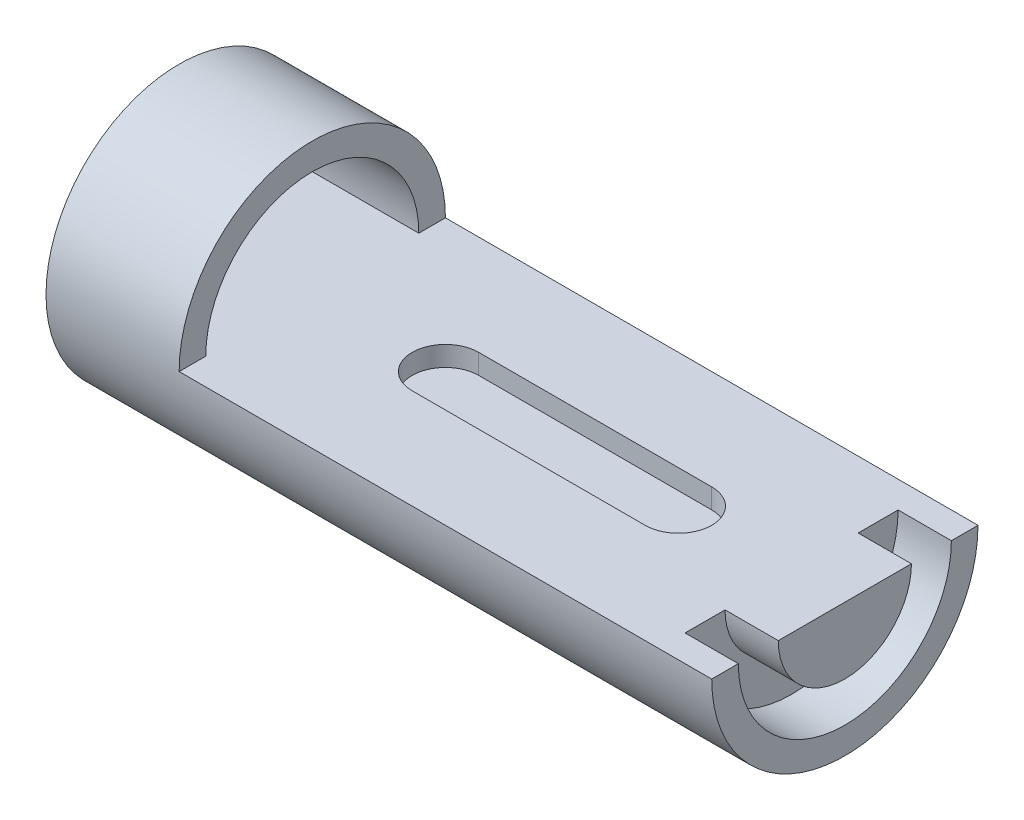
ISO-10303-21;
HEADER;
FILE_DESCRIPTION(('STEP AP214'),'2;1');
FILE_NAME('part.step','',(''),(''),'','','');
FILE_SCHEMA(('AUTOMOTIVE_DESIGN { 1 0 10303 214 1 1 1 1 }'));
ENDSEC;
DATA;
#1=APPLICATION_CONTEXT('core data for automotive mechanical design processes');
#2=APPLICATION_PROTOCOL_DEFINITION('international standard','automotive_design',2000,#1);
#3=PRODUCT_CONTEXT('',#1,'mechanical');
#4=PRODUCT('Part','Part','',(#3));
#5=PRODUCT_RELATED_PRODUCT_CATEGORY('part','',(#4));
#6=PRODUCT_DEFINITION_FORMATION('','',#4);
#7=PRODUCT_DEFINITION_CONTEXT('part definition',#1,'design');
#8=PRODUCT_DEFINITION('design','',#6,#7);
#9=PRODUCT_DEFINITION_SHAPE('','',#8);
#10=(LENGTH_UNIT() NAMED_UNIT(*) SI_UNIT(.MILLI.,.METRE.));
#11=(NAMED_UNIT(*) PLANE_ANGLE_UNIT() SI_UNIT($,.RADIAN.));
#12=(NAMED_UNIT(*) SI_UNIT($,.STERADIAN.) SOLID_ANGLE_UNIT());
#13=UNCERTAINTY_MEASURE_WITH_UNIT(LENGTH_MEASURE(1.E-05),#10,'distance_accuracy_value','');
#14=(GEOMETRIC_REPRESENTATION_CONTEXT(3) GLOBAL_UNCERTAINTY_ASSIGNED_CONTEXT((#13)) GLOBAL_UNIT_ASSIGNED_CONTEXT((#10,
#11,#12)) REPRESENTATION_CONTEXT('',''));
#15=CARTESIAN_POINT('',(0.,0.,0.));
#16=DIRECTION('',(0.,0.,1.));
#17=DIRECTION('',(1.,0.,0.));
#18=AXIS2_PLACEMENT_3D('',#15,#16,#17);
#19=CARTESIAN_POINT('',(80000.,0.,20000.));
#20=DIRECTION('',(1.,0.,0.));
#21=DIRECTION('',(0.,0.,-1.));
#22=AXIS2_PLACEMENT_3D('',#19,#20,#21);
#23=CYLINDRICAL_SURFACE('',#22,16000.);
#24=CARTESIAN_POINT('',(20000.,0.,20000.));
#25=DIRECTION('',(-1.,0.,0.));
#26=DIRECTION('',(0.,0.,1.));
#27=AXIS2_PLACEMENT_3D('',#24,#25,#26);
#28=CIRCLE('',#27,16000.);
#29=CARTESIAN_POINT('',(20000.,2.51386656396706E-10,36000.));
#30=VERTEX_POINT('',#29);
#31=CARTESIAN_POINT('',(20000.,2.79318507107451E-11,4000.00000000001));
#32=VERTEX_POINT('',#31);
#33=EDGE_CURVE('E129',#30,#32,#28,.T.);
#34=ORIENTED_EDGE('',*,*,#33,.F.);
#35=DIRECTION('',(-1.,0.,0.));
#36=VECTOR('',#35,1.);
#37=CARTESIAN_POINT('',(100000.,0.,36000.));
#38=LINE('',#37,#36);
#39=CARTESIAN_POINT('',(6.3948846218409E-12,0.,36000.));
#40=VERTEX_POINT('',#39);
#41=EDGE_CURVE('E159',#30,#40,#38,.T.);
#42=ORIENTED_EDGE('',*,*,#41,.T.);
#43=CARTESIAN_POINT('',(3.5527136788005E-12,0.,20000.));
#44=DIRECTION('',(-1.,0.,0.));
#45=DIRECTION('',(0.,0.,1.));
#46=AXIS2_PLACEMENT_3D('',#43,#44,#45);
#47=CIRCLE('',#46,16000.);
#48=CARTESIAN_POINT('',(1.58832695507201E-13,0.,3999.99999999999));
#49=VERTEX_POINT('',#48);
#50=EDGE_CURVE('E147',#40,#49,#47,.T.);
#51=ORIENTED_EDGE('',*,*,#50,.T.);
#52=DIRECTION('',(-1.,0.,0.));
#53=VECTOR('',#52,1.);
#54=CARTESIAN_POINT('',(100000.,0.,3999.99999999999));
#55=LINE('',#54,#53);
#56=EDGE_CURVE('E56',#32,#49,#55,.T.);
#57=ORIENTED_EDGE('',*,*,#56,.F.);
#58=EDGE_LOOP('',(#34,#42,#51,#57));
#59=FACE_BOUND('',#58,.T.);
#60=ADVANCED_FACE('F34',(#59),#23,.F.);
#61=CARTESIAN_POINT('',(80000.,0.,20000.));
#62=DIRECTION('',(1.,0.,0.));
#63=DIRECTION('',(0.,0.,-1.));
#64=AXIS2_PLACEMENT_3D('',#61,#62,#63);
#65=CYLINDRICAL_SURFACE('',#64,20000.);
#66=DIRECTION('',(-1.,0.,0.));
#67=VECTOR('',#66,1.);
#68=CARTESIAN_POINT('',(100000.,2.79318507107452E-10,40000.0000000002));
#69=LINE('',#68,#67);
#70=CARTESIAN_POINT('',(100000.,2.79318507107452E-10,40000.0000000002));
#71=VERTEX_POINT('',#70);
#72=CARTESIAN_POINT('',(20000.,2.79318507107452E-10,40000.0000000002));
#73=VERTEX_POINT('',#72);
#74=EDGE_CURVE('E140',#71,#73,#69,.T.);
#75=ORIENTED_EDGE('',*,*,#74,.T.);
#76=CARTESIAN_POINT('',(20000.,0.,20000.));
#77=DIRECTION('',(-1.,0.,0.));
#78=DIRECTION('',(0.,0.,1.));
#79=AXIS2_PLACEMENT_3D('',#76,#77,#78);
#80=CIRCLE('',#79,20000.);
#81=CARTESIAN_POINT('',(20000.,0.,-1.4210854715202E-10));
#82=VERTEX_POINT('',#81);
#83=EDGE_CURVE('E126',#82,#73,#80,.F.);
#84=ORIENTED_EDGE('',*,*,#83,.F.);
#85=DIRECTION('',(-1.,0.,0.));
#86=VECTOR('',#85,1.);
#87=CARTESIAN_POINT('',(100000.,0.,-1.49213974509621E-10));
#88=LINE('',#87,#86);
#89=CARTESIAN_POINT('',(100000.,0.,0.));
#90=VERTEX_POINT('',#89);
#91=EDGE_CURVE('E133',#90,#82,#88,.T.);
#92=ORIENTED_EDGE('',*,*,#91,.F.);
#93=CARTESIAN_POINT('',(100000.,0.,20000.));
#94=DIRECTION('',(1.,0.,0.));
#95=DIRECTION('',(0.,0.,-1.));
#96=AXIS2_PLACEMENT_3D('',#93,#94,#95);
#97=CIRCLE('',#96,20000.);
#98=EDGE_CURVE('E209',#71,#90,#97,.T.);
#99=ORIENTED_EDGE('',*,*,#98,.F.);
#100=EDGE_LOOP('',(#75,#84,#92,#99));
#101=FACE_BOUND('',#100,.T.);
#102=CARTESIAN_POINT('',(0.,0.,20000.));
#103=DIRECTION('',(1.,0.,0.));
#104=DIRECTION('',(0.,0.,-1.));
#105=AXIS2_PLACEMENT_3D('',#102,#103,#104);
#106=CIRCLE('',#105,20000.);
#107=CARTESIAN_POINT('',(-3.5527136788005E-12,0.,0.));
#108=VERTEX_POINT('',#107);
#109=EDGE_CURVE('E198',#108,#108,#106,.T.);
#110=ORIENTED_EDGE('',*,*,#109,.T.);
#111=EDGE_LOOP('',(#110));
#112=FACE_BOUND('',#111,.T.);
#113=ADVANCED_FACE('F143',(#101,#112),#65,.T.);
#114=CARTESIAN_POINT('',(-5.51710040252897E-13,0.,0.));
#115=DIRECTION('',(-1.,0.,0.));
#116=DIRECTION('',(0.,0.,1.));
#117=AXIS2_PLACEMENT_3D('',#114,#115,#116);
#118=PLANE('',#117);
#119=ORIENTED_EDGE('',*,*,#50,.F.);
#120=DIRECTION('',(0.,0.,1.));
#121=VECTOR('',#120,1.);
#122=CARTESIAN_POINT('',(7.10542735760101E-13,0.,4000.00000000001));
#123=LINE('',#122,#121);
#124=EDGE_CURVE('E156',#49,#40,#123,.T.);
#125=ORIENTED_EDGE('',*,*,#124,.F.);
#126=EDGE_LOOP('',(#119,#125));
#127=FACE_BOUND('',#126,.T.);
#128=ORIENTED_EDGE('',*,*,#109,.F.);
#129=EDGE_LOOP('',(#128));
#130=FACE_BOUND('',#129,.T.);
#131=ADVANCED_FACE('F36',(#127,#130),#118,.T.);
#132=CARTESIAN_POINT('',(100000.,0.,9999.99999999999));
#133=DIRECTION('',(1.,0.,0.));
#134=DIRECTION('',(0.,0.,-1.));
#135=AXIS2_PLACEMENT_3D('',#132,#133,#134);
#136=PLANE('',#135);
#137=DIRECTION('',(0.,0.,1.));
#138=VECTOR('',#137,1.);
#139=CARTESIAN_POINT('',(100000.,0.,3999.99999999999));
#140=LINE('',#139,#138);
#141=CARTESIAN_POINT('',(100000.,0.,9999.99999999999));
#142=VERTEX_POINT('',#141);
#143=CARTESIAN_POINT('',(100000.,0.,30000.));
#144=VERTEX_POINT('',#143);
#145=EDGE_CURVE('E153',#142,#144,#140,.T.);
#146=ORIENTED_EDGE('',*,*,#145,.T.);
#147=CARTESIAN_POINT('',(100000.,0.,20000.));
#148=DIRECTION('',(1.,0.,0.));
#149=DIRECTION('',(0.,0.,-1.));
#150=AXIS2_PLACEMENT_3D('',#147,#148,#149);
#151=CIRCLE('',#150,10000.);
#152=EDGE_CURVE('E11',#144,#142,#151,.T.);
#153=ORIENTED_EDGE('',*,*,#152,.T.);
#154=EDGE_LOOP('',(#146,#153));
#155=FACE_BOUND('',#154,.T.);
#156=ADVANCED_FACE('F229',(#155),#136,.T.);
#157=CARTESIAN_POINT('',(80000.,0.,20000.));
#158=DIRECTION('',(1.,0.,0.));
#159=DIRECTION('',(0.,0.,-1.));
#160=AXIS2_PLACEMENT_3D('',#157,#158,#159);
#161=CYLINDRICAL_SURFACE('',#160,10000.);
#162=DIRECTION('',(1.,0.,0.));
#163=VECTOR('',#162,1.);
#164=CARTESIAN_POINT('',(80000.,0.,10000.));
#165=LINE('',#164,#163);
#166=CARTESIAN_POINT('',(92000.,0.,9999.99999999999));
#167=VERTEX_POINT('',#166);
#168=EDGE_CURVE('E165',#142,#167,#165,.F.);
#169=ORIENTED_EDGE('',*,*,#168,.F.);
#170=ORIENTED_EDGE('',*,*,#152,.F.);
#171=DIRECTION('',(1.,0.,0.));
#172=VECTOR('',#171,1.);
#173=CARTESIAN_POINT('',(80000.,0.,30000.));
#174=LINE('',#173,#172);
#175=CARTESIAN_POINT('',(92000.,0.,30000.));
#176=VERTEX_POINT('',#175);
#177=EDGE_CURVE('E168',#176,#144,#174,.T.);
#178=ORIENTED_EDGE('',*,*,#177,.F.);
#179=CARTESIAN_POINT('',(92000.,0.,20000.));
#180=DIRECTION('',(1.,0.,0.));
#181=DIRECTION('',(0.,0.,-1.));
#182=AXIS2_PLACEMENT_3D('',#179,#180,#181);
#183=CIRCLE('',#182,10000.);
#184=EDGE_CURVE('E42',#176,#167,#183,.T.);
#185=ORIENTED_EDGE('',*,*,#184,.T.);
#186=EDGE_LOOP('',(#169,#170,#178,#185));
#187=FACE_BOUND('',#186,.T.);
#188=ADVANCED_FACE('F221',(#187),#161,.T.);
#189=CARTESIAN_POINT('',(92000.,0.,3999.99999999999));
#190=DIRECTION('',(1.,0.,0.));
#191=DIRECTION('',(0.,0.,-1.));
#192=AXIS2_PLACEMENT_3D('',#189,#190,#191);
#193=PLANE('',#192);
#194=DIRECTION('',(0.,0.,-1.));
#195=VECTOR('',#194,1.);
#196=CARTESIAN_POINT('',(92000.,0.,3999.99999999999));
#197=LINE('',#196,#195);
#198=CARTESIAN_POINT('',(92000.,2.51386656396705E-10,36000.));
#199=VERTEX_POINT('',#198);
#200=EDGE_CURVE('E166',#199,#176,#197,.T.);
#201=ORIENTED_EDGE('',*,*,#200,.F.);
#202=CARTESIAN_POINT('',(92000.,0.,20000.));
#203=DIRECTION('',(1.,0.,0.));
#204=DIRECTION('',(0.,0.,-1.));
#205=AXIS2_PLACEMENT_3D('',#202,#203,#204);
#206=CIRCLE('',#205,16000.);
#207=CARTESIAN_POINT('',(92000.,2.79318507107449E-11,3999.99999999999));
#208=VERTEX_POINT('',#207);
#209=EDGE_CURVE('E214',#199,#208,#206,.T.);
#210=ORIENTED_EDGE('',*,*,#209,.T.);
#211=EDGE_CURVE('E161',#167,#208,#197,.T.);
#212=ORIENTED_EDGE('',*,*,#211,.F.);
#213=ORIENTED_EDGE('',*,*,#184,.F.);
#214=EDGE_LOOP('',(#201,#210,#212,#213));
#215=FACE_BOUND('',#214,.T.);
#216=ADVANCED_FACE('F226',(#215),#193,.T.);
#217=DIRECTION('',(1.,0.,0.));
#218=VECTOR('',#217,1.);
#219=CARTESIAN_POINT('',(80000.,2.79318507107449E-11,3999.99999999999));
#220=LINE('',#219,#218);
#221=CARTESIAN_POINT('',(100000.,2.7931850710745E-11,4000.));
#222=VERTEX_POINT('',#221);
#223=EDGE_CURVE('E145',#208,#222,#220,.T.);
#224=ORIENTED_EDGE('',*,*,#223,.F.);
#225=ORIENTED_EDGE('',*,*,#209,.F.);
#226=DIRECTION('',(1.,0.,0.));
#227=VECTOR('',#226,1.);
#228=CARTESIAN_POINT('',(80000.,2.51386656396705E-10,36000.));
#229=LINE('',#228,#227);
#230=CARTESIAN_POINT('',(100000.,2.51386656396706E-10,36000.));
#231=VERTEX_POINT('',#230);
#232=EDGE_CURVE('E149',#231,#199,#229,.F.);
#233=ORIENTED_EDGE('',*,*,#232,.F.);
#234=CARTESIAN_POINT('',(100000.,0.,20000.));
#235=DIRECTION('',(1.,0.,0.));
#236=DIRECTION('',(0.,0.,-1.));
#237=AXIS2_PLACEMENT_3D('',#234,#235,#236);
#238=CIRCLE('',#237,16000.);
#239=EDGE_CURVE('E211',#231,#222,#238,.T.);
#240=ORIENTED_EDGE('',*,*,#239,.T.);
#241=EDGE_LOOP('',(#224,#225,#233,#240));
#242=FACE_BOUND('',#241,.T.);
#243=ADVANCED_FACE('F240',(#242),#23,.F.);
#244=CARTESIAN_POINT('',(100000.,0.,0.));
#245=DIRECTION('',(1.,0.,0.));
#246=DIRECTION('',(0.,0.,-1.));
#247=AXIS2_PLACEMENT_3D('',#244,#245,#246);
#248=PLANE('',#247);
#249=DIRECTION('',(0.,0.,-1.));
#250=VECTOR('',#249,1.);
#251=CARTESIAN_POINT('',(100000.,2.79318507107452E-10,40000.0000000002));
#252=LINE('',#251,#250);
#253=EDGE_CURVE('E131',#71,#231,#252,.T.);
#254=ORIENTED_EDGE('',*,*,#253,.F.);
#255=ORIENTED_EDGE('',*,*,#98,.T.);
#256=EDGE_CURVE('E49',#222,#90,#252,.T.);
#257=ORIENTED_EDGE('',*,*,#256,.F.);
#258=ORIENTED_EDGE('',*,*,#239,.F.);
#259=EDGE_LOOP('',(#254,#255,#257,#258));
#260=FACE_BOUND('',#259,.T.);
#261=ADVANCED_FACE('F248',(#260),#248,.T.);
#262=CARTESIAN_POINT('',(100000.,0.,3999.99999999999));
#263=DIRECTION('',(0.,-1.,0.));
#264=DIRECTION('',(0.,0.,-1.));
#265=AXIS2_PLACEMENT_3D('',#262,#263,#264);
#266=PLANE('',#265);
#267=ORIENTED_EDGE('',*,*,#41,.F.);
#268=DIRECTION('',(0.,0.,-1.));
#269=VECTOR('',#268,1.);
#270=CARTESIAN_POINT('',(20000.,2.79318507107452E-10,40000.0000000002));
#271=LINE('',#270,#269);
#272=EDGE_CURVE('E130',#73,#30,#271,.T.);
#273=ORIENTED_EDGE('',*,*,#272,.F.);
#274=ORIENTED_EDGE('',*,*,#74,.F.);
#275=ORIENTED_EDGE('',*,*,#253,.T.);
#276=ORIENTED_EDGE('',*,*,#232,.T.);
#277=ORIENTED_EDGE('',*,*,#200,.T.);
#278=ORIENTED_EDGE('',*,*,#177,.T.);
#279=ORIENTED_EDGE('',*,*,#145,.F.);
#280=ORIENTED_EDGE('',*,*,#168,.T.);
#281=ORIENTED_EDGE('',*,*,#211,.T.);
#282=ORIENTED_EDGE('',*,*,#223,.T.);
#283=ORIENTED_EDGE('',*,*,#256,.T.);
#284=ORIENTED_EDGE('',*,*,#91,.T.);
#285=EDGE_CURVE('E123',#32,#82,#271,.T.);
#286=ORIENTED_EDGE('',*,*,#285,.F.);
#287=ORIENTED_EDGE('',*,*,#56,.T.);
#288=ORIENTED_EDGE('',*,*,#124,.T.);
#289=EDGE_LOOP('',(#267,#273,#274,#275,#276,#277,#278,#279,#280,#281,#282,#283,#284,#286,#287,#288));
#290=FACE_BOUND('',#289,.T.);
#291=DIRECTION('',(-1.,0.,0.));
#292=VECTOR('',#291,1.);
#293=CARTESIAN_POINT('',(40000.,1.04744440165294E-10,15000.));
#294=LINE('',#293,#292);
#295=CARTESIAN_POINT('',(75000.,0.,15000.));
#296=VERTEX_POINT('',#295);
#297=CARTESIAN_POINT('',(40000.,0.,15000.));
#298=VERTEX_POINT('',#297);
#299=EDGE_CURVE('E175',#296,#298,#294,.T.);
#300=ORIENTED_EDGE('',*,*,#299,.F.);
#301=CARTESIAN_POINT('',(75000.,1.39659253553725E-10,20000.));
#302=DIRECTION('',(0.,1.,0.));
#303=DIRECTION('',(0.,0.,1.));
#304=AXIS2_PLACEMENT_3D('',#301,#302,#303);
#305=CIRCLE('',#304,5000.);
#306=CARTESIAN_POINT('',(75000.,1.74574066942157E-10,25000.));
#307=VERTEX_POINT('',#306);
#308=EDGE_CURVE('E190',#307,#296,#305,.T.);
#309=ORIENTED_EDGE('',*,*,#308,.F.);
#310=DIRECTION('',(1.,0.,0.));
#311=VECTOR('',#310,1.);
#312=CARTESIAN_POINT('',(40000.,1.74574066942157E-10,25000.));
#313=LINE('',#312,#311);
#314=CARTESIAN_POINT('',(40000.,0.,25000.));
#315=VERTEX_POINT('',#314);
#316=EDGE_CURVE('E187',#315,#307,#313,.T.);
#317=ORIENTED_EDGE('',*,*,#316,.F.);
#318=CARTESIAN_POINT('',(40000.,1.39659253553725E-10,20000.));
#319=DIRECTION('',(0.,1.,0.));
#320=DIRECTION('',(0.,0.,1.));
#321=AXIS2_PLACEMENT_3D('',#318,#319,#320);
#322=CIRCLE('',#321,5000.);
#323=EDGE_CURVE('E170',#298,#315,#322,.T.);
#324=ORIENTED_EDGE('',*,*,#323,.F.);
#325=EDGE_LOOP('',(#300,#309,#317,#324));
#326=FACE_BOUND('',#325,.T.);
#327=ADVANCED_FACE('F135',(#290,#326),#266,.F.);
#328=CARTESIAN_POINT('',(40000.,-2999.99999999986,20000.));
#329=DIRECTION('',(0.,1.,0.));
#330=DIRECTION('',(0.,0.,1.));
#331=AXIS2_PLACEMENT_3D('',#328,#329,#330);
#332=CYLINDRICAL_SURFACE('',#331,5000.);
#333=ORIENTED_EDGE('',*,*,#323,.T.);
#334=DIRECTION('',(0.,1.,0.));
#335=VECTOR('',#334,1.);
#336=CARTESIAN_POINT('',(40000.,-2999.99999999983,25000.));
#337=LINE('',#336,#335);
#338=CARTESIAN_POINT('',(40000.,-2999.99999999983,25000.));
#339=VERTEX_POINT('',#338);
#340=EDGE_CURVE('E184',#339,#315,#337,.T.);
#341=ORIENTED_EDGE('',*,*,#340,.F.);
#342=CARTESIAN_POINT('',(40000.,-2999.99999999986,20000.));
#343=DIRECTION('',(0.,1.,0.));
#344=DIRECTION('',(0.,0.,1.));
#345=AXIS2_PLACEMENT_3D('',#342,#343,#344);
#346=CIRCLE('',#345,5000.);
#347=CARTESIAN_POINT('',(40000.,-2999.9999999999,15000.));
#348=VERTEX_POINT('',#347);
#349=EDGE_CURVE('E171',#348,#339,#346,.T.);
#350=ORIENTED_EDGE('',*,*,#349,.F.);
#351=DIRECTION('',(0.,1.,0.));
#352=VECTOR('',#351,1.);
#353=CARTESIAN_POINT('',(40000.,-2999.9999999999,15000.));
#354=LINE('',#353,#352);
#355=EDGE_CURVE('E195',#348,#298,#354,.T.);
#356=ORIENTED_EDGE('',*,*,#355,.T.);
#357=EDGE_LOOP('',(#333,#341,#350,#356));
#358=FACE_BOUND('',#357,.T.);
#359=ADVANCED_FACE('F279',(#358),#332,.F.);
#360=CARTESIAN_POINT('',(40000.,-2999.9999999999,15000.));
#361=DIRECTION('',(0.,0.,-1.));
#362=DIRECTION('',(0.,1.,0.));
#363=AXIS2_PLACEMENT_3D('',#360,#361,#362);
#364=PLANE('',#363);
#365=ORIENTED_EDGE('',*,*,#299,.T.);
#366=ORIENTED_EDGE('',*,*,#355,.F.);
#367=DIRECTION('',(-1.,0.,0.));
#368=VECTOR('',#367,1.);
#369=CARTESIAN_POINT('',(40000.,-2999.9999999999,15000.));
#370=LINE('',#369,#368);
#371=CARTESIAN_POINT('',(75000.,-2999.9999999999,15000.));
#372=VERTEX_POINT('',#371);
#373=EDGE_CURVE('E181',#372,#348,#370,.T.);
#374=ORIENTED_EDGE('',*,*,#373,.F.);
#375=DIRECTION('',(0.,1.,0.));
#376=VECTOR('',#375,1.);
#377=CARTESIAN_POINT('',(75000.,-2999.9999999999,15000.));
#378=LINE('',#377,#376);
#379=EDGE_CURVE('E199',#372,#296,#378,.T.);
#380=ORIENTED_EDGE('',*,*,#379,.T.);
#381=EDGE_LOOP('',(#365,#366,#374,#380));
#382=FACE_BOUND('',#381,.T.);
#383=ADVANCED_FACE('F284',(#382),#364,.F.);
#384=CARTESIAN_POINT('',(75000.,-2999.99999999986,20000.));
#385=DIRECTION('',(0.,1.,0.));
#386=DIRECTION('',(0.,0.,1.));
#387=AXIS2_PLACEMENT_3D('',#384,#385,#386);
#388=CYLINDRICAL_SURFACE('',#387,5000.);
#389=ORIENTED_EDGE('',*,*,#308,.T.);
#390=ORIENTED_EDGE('',*,*,#379,.F.);
#391=CARTESIAN_POINT('',(75000.,-2999.99999999986,20000.));
#392=DIRECTION('',(0.,1.,0.));
#393=DIRECTION('',(0.,0.,1.));
#394=AXIS2_PLACEMENT_3D('',#391,#392,#393);
#395=CIRCLE('',#394,5000.);
#396=CARTESIAN_POINT('',(75000.,-2999.99999999983,25000.));
#397=VERTEX_POINT('',#396);
#398=EDGE_CURVE('E178',#397,#372,#395,.T.);
#399=ORIENTED_EDGE('',*,*,#398,.F.);
#400=DIRECTION('',(0.,1.,0.));
#401=VECTOR('',#400,1.);
#402=CARTESIAN_POINT('',(75000.,-2999.99999999983,25000.));
#403=LINE('',#402,#401);
#404=EDGE_CURVE('E202',#397,#307,#403,.T.);
#405=ORIENTED_EDGE('',*,*,#404,.T.);
#406=EDGE_LOOP('',(#389,#390,#399,#405));
#407=FACE_BOUND('',#406,.T.);
#408=ADVANCED_FACE('F296',(#407),#388,.F.);
#409=CARTESIAN_POINT('',(40000.,-2999.99999999983,25000.));
#410=DIRECTION('',(0.,0.,1.));
#411=DIRECTION('',(0.,-1.,0.));
#412=AXIS2_PLACEMENT_3D('',#409,#410,#411);
#413=PLANE('',#412);
#414=ORIENTED_EDGE('',*,*,#316,.T.);
#415=ORIENTED_EDGE('',*,*,#404,.F.);
#416=DIRECTION('',(1.,0.,0.));
#417=VECTOR('',#416,1.);
#418=CARTESIAN_POINT('',(40000.,-2999.99999999983,25000.));
#419=LINE('',#418,#417);
#420=EDGE_CURVE('E174',#339,#397,#419,.T.);
#421=ORIENTED_EDGE('',*,*,#420,.F.);
#422=ORIENTED_EDGE('',*,*,#340,.T.);
#423=EDGE_LOOP('',(#414,#415,#421,#422));
#424=FACE_BOUND('',#423,.T.);
#425=ADVANCED_FACE('F306',(#424),#413,.F.);
#426=CARTESIAN_POINT('',(40000.,-2999.99999999986,20000.));
#427=DIRECTION('',(0.,1.,0.));
#428=DIRECTION('',(0.,0.,1.));
#429=AXIS2_PLACEMENT_3D('',#426,#427,#428);
#430=PLANE('',#429);
#431=ORIENTED_EDGE('',*,*,#349,.T.);
#432=ORIENTED_EDGE('',*,*,#420,.T.);
#433=ORIENTED_EDGE('',*,*,#398,.T.);
#434=ORIENTED_EDGE('',*,*,#373,.T.);
#435=EDGE_LOOP('',(#431,#432,#433,#434));
#436=FACE_BOUND('',#435,.T.);
#437=ADVANCED_FACE('F315',(#436),#430,.T.);
#438=CARTESIAN_POINT('',(20000.,20000.0000000001,40000.));
#439=DIRECTION('',(-1.,0.,0.));
#440=DIRECTION('',(0.,0.,1.));
#441=AXIS2_PLACEMENT_3D('',#438,#439,#440);
#442=PLANE('',#441);
#443=ORIENTED_EDGE('',*,*,#33,.T.);
#444=ORIENTED_EDGE('',*,*,#285,.T.);
#445=ORIENTED_EDGE('',*,*,#83,.T.);
#446=ORIENTED_EDGE('',*,*,#272,.T.);
#447=EDGE_LOOP('',(#443,#444,#445,#446));
#448=FACE_BOUND('',#447,.T.);
#449=ADVANCED_FACE('F124',(#448),#442,.F.);
#450=CLOSED_SHELL('',(#60,#113,#131,#156,#188,#216,#243,#261,#327,#359,#383,#408,#425,#437,#449));
#451=MANIFOLD_SOLID_BREP('B2',#450);
#452=ADVANCED_BREP_SHAPE_REPRESENTATION('',(#18,#451),#14);
#453=SHAPE_DEFINITION_REPRESENTATION(#9,#452);
ENDSEC;
END-ISO-10303-21;
